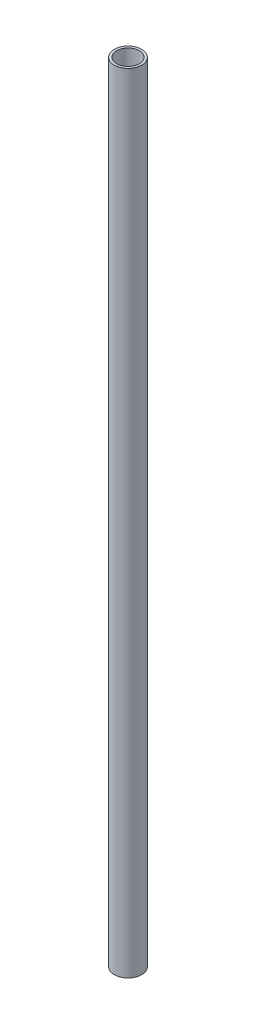
ISO-10303-21;
HEADER;
FILE_DESCRIPTION(('STEP AP214'),'2;1');
FILE_NAME('part.step','',(''),(''),'','','');
FILE_SCHEMA(('AUTOMOTIVE_DESIGN { 1 0 10303 214 1 1 1 1 }'));
ENDSEC;
DATA;
#1=APPLICATION_CONTEXT('core data for automotive mechanical design processes');
#2=APPLICATION_PROTOCOL_DEFINITION('international standard','automotive_design',2000,#1);
#3=PRODUCT_CONTEXT('',#1,'mechanical');
#4=PRODUCT('Part','Part','',(#3));
#5=PRODUCT_RELATED_PRODUCT_CATEGORY('part','',(#4));
#6=PRODUCT_DEFINITION_FORMATION('','',#4);
#7=PRODUCT_DEFINITION_CONTEXT('part definition',#1,'design');
#8=PRODUCT_DEFINITION('design','',#6,#7);
#9=PRODUCT_DEFINITION_SHAPE('','',#8);
#10=(LENGTH_UNIT() NAMED_UNIT(*) SI_UNIT(.MILLI.,.METRE.));
#11=(NAMED_UNIT(*) PLANE_ANGLE_UNIT() SI_UNIT($,.RADIAN.));
#12=(NAMED_UNIT(*) SI_UNIT($,.STERADIAN.) SOLID_ANGLE_UNIT());
#13=UNCERTAINTY_MEASURE_WITH_UNIT(LENGTH_MEASURE(1.E-05),#10,'distance_accuracy_value','');
#14=(GEOMETRIC_REPRESENTATION_CONTEXT(3) GLOBAL_UNCERTAINTY_ASSIGNED_CONTEXT((#13)) GLOBAL_UNIT_ASSIGNED_CONTEXT((#10,
#11,#12)) REPRESENTATION_CONTEXT('',''));
#15=CARTESIAN_POINT('',(0.,0.,0.));
#16=DIRECTION('',(0.,0.,1.));
#17=DIRECTION('',(1.,0.,0.));
#18=AXIS2_PLACEMENT_3D('',#15,#16,#17);
#19=CARTESIAN_POINT('',(0.,546.1,0.));
#20=DIRECTION('',(0.,-1.,0.));
#21=DIRECTION('',(0.,0.,-1.));
#22=AXIS2_PLACEMENT_3D('',#19,#20,#21);
#23=CYLINDRICAL_SURFACE('',#22,9.525);
#24=CARTESIAN_POINT('',(0.,546.1,0.));
#25=DIRECTION('',(0.,1.,0.));
#26=DIRECTION('',(0.,0.,1.));
#27=AXIS2_PLACEMENT_3D('',#24,#25,#26);
#28=CIRCLE('',#27,9.525);
#29=CARTESIAN_POINT('',(0.,546.1,9.525));
#30=VERTEX_POINT('',#29);
#31=EDGE_CURVE('E10',#30,#30,#28,.T.);
#32=ORIENTED_EDGE('',*,*,#31,.F.);
#33=EDGE_LOOP('',(#32));
#34=FACE_BOUND('',#33,.T.);
#35=CARTESIAN_POINT('',(0.,0.,0.));
#36=DIRECTION('',(0.,1.,0.));
#37=DIRECTION('',(0.,0.,1.));
#38=AXIS2_PLACEMENT_3D('',#35,#36,#37);
#39=CIRCLE('',#38,9.525);
#40=CARTESIAN_POINT('',(0.,0.,9.525));
#41=VERTEX_POINT('',#40);
#42=EDGE_CURVE('E47',#41,#41,#39,.T.);
#43=ORIENTED_EDGE('',*,*,#42,.T.);
#44=EDGE_LOOP('',(#43));
#45=FACE_BOUND('',#44,.T.);
#46=CARTESIAN_POINT('',(0.70182659001416,6.34999999999997,-9.49910861278831));
#47=CARTESIAN_POINT('',(0.701830425661844,6.43850360008196,-9.49910931448811));
#48=CARTESIAN_POINT('',(0.709339903143834,6.52705552985514,-9.49856271931088));
#49=CARTESIAN_POINT('',(0.73914114067249,6.70167477497227,-9.49628928458247));
#50=CARTESIAN_POINT('',(0.761446533018649,6.78773972253638,-9.49456135655856));
#51=CARTESIAN_POINT('',(0.820071790311437,6.95483259992182,-9.48967683733146));
#52=CARTESIAN_POINT('',(0.856379942635018,7.03586467390046,-9.48652143975602));
#53=CARTESIAN_POINT('',(0.941838491318716,7.19072790624575,-9.4784175389685));
#54=CARTESIAN_POINT('',(0.990987442481666,7.26455987368155,-9.47346923751867));
#55=CARTESIAN_POINT('',(1.10111043538638,7.40366365958773,-9.46130370946585));
#56=CARTESIAN_POINT('',(1.16218497939736,7.46885420843018,-9.45406685023204));
#57=CARTESIAN_POINT('',(1.29404812032065,7.58811874985718,-9.43692092075347));
#58=CARTESIAN_POINT('',(1.36483729255761,7.64219208357822,-9.42701169221072));
#59=CARTESIAN_POINT('',(1.51449734229077,7.73799225018417,-9.40413092200805));
#60=CARTESIAN_POINT('',(1.59341394308883,7.77964344990963,-9.39114145211831));
#61=CARTESIAN_POINT('',(1.75662974584085,7.84893087978683,-9.36198381502255));
#62=CARTESIAN_POINT('',(1.84092859741093,7.87656802120682,-9.34581585459371));
#63=CARTESIAN_POINT('',(2.01160302448579,7.9167942597147,-9.31056377324197));
#64=CARTESIAN_POINT('',(2.0979522486908,7.92951990166291,-9.29150794718033));
#65=CARTESIAN_POINT('',(2.27093107961967,7.93998650388682,-9.25075077348331));
#66=CARTESIAN_POINT('',(2.35756066688564,7.93772848268192,-9.22904960576432));
#67=CARTESIAN_POINT('',(2.52774621700173,7.91839834177951,-9.1838881646519));
#68=CARTESIAN_POINT('',(2.6113241244069,7.90147317123512,-9.16044744339301));
#69=CARTESIAN_POINT('',(2.77400754332395,7.85352056785341,-9.11250258745171));
#70=CARTESIAN_POINT('',(2.85311291853981,7.82249270551059,-9.08799842040202));
#71=CARTESIAN_POINT('',(3.00511855092452,7.7470694433997,-9.03887732382664));
#72=CARTESIAN_POINT('',(3.0779887405165,7.70261349232758,-9.01426039167741));
#73=CARTESIAN_POINT('',(3.21527487209395,7.60164035762668,-8.96621048941902));
#74=CARTESIAN_POINT('',(3.27969012915061,7.54512219781857,-8.94277761532412));
#75=CARTESIAN_POINT('',(3.39920152166464,7.42081395779668,-8.89804375335308));
#76=CARTESIAN_POINT('',(3.45417511594069,7.35289544473781,-8.87677207864973));
#77=CARTESIAN_POINT('',(3.55245605313273,7.2081471977129,-8.83790036162596));
#78=CARTESIAN_POINT('',(3.59576328843563,7.13131738155635,-8.82030035317413));
#79=CARTESIAN_POINT('',(3.66964284544777,6.97078130740775,-8.78982099024054));
#80=CARTESIAN_POINT('',(3.70020084883979,6.88706744371147,-8.77694694529859));
#81=CARTESIAN_POINT('',(3.74769225599735,6.71522083908467,-8.75677451691312));
#82=CARTESIAN_POINT('',(3.76462685941796,6.62708848796537,-8.74947564253175));
#83=CARTESIAN_POINT('',(3.7842889121477,6.45003399083701,-8.74098949283711));
#84=CARTESIAN_POINT('',(3.78718362565519,6.36113384888913,-8.73973026621225));
#85=CARTESIAN_POINT('',(3.77914023661004,6.1840829634763,-8.74321122633754));
#86=CARTESIAN_POINT('',(3.76820266834298,6.0959321911986,-8.74795118136336));
#87=CARTESIAN_POINT('',(3.73290722327832,5.92345287291378,-8.76306964769297));
#88=CARTESIAN_POINT('',(3.70863467588485,5.83910367617744,-8.7734123019779));
#89=CARTESIAN_POINT('',(3.64736302234473,5.67596644441251,-8.79906042876483));
#90=CARTESIAN_POINT('',(3.61036315486636,5.59717874240516,-8.81436619815077));
#91=CARTESIAN_POINT('',(3.52417082208061,5.44660163255211,-8.84918171740491));
#92=CARTESIAN_POINT('',(3.47486904586504,5.3748834762999,-8.86872894063804));
#93=CARTESIAN_POINT('',(3.36547355377802,5.24121790673867,-8.91081585449821));
#94=CARTESIAN_POINT('',(3.30537907883953,5.17927118124531,-8.93335575557578));
#95=CARTESIAN_POINT('',(3.17520227844955,5.06625104811727,-8.98045359896899));
#96=CARTESIAN_POINT('',(3.10502258120932,5.01529742030932,-9.00503009063644));
#97=CARTESIAN_POINT('',(2.95695680115594,4.9265488673519,-9.05472920927627));
#98=CARTESIAN_POINT('',(2.87907096772522,4.88875351655911,-9.07985181855493));
#99=CARTESIAN_POINT('',(2.7180273101702,4.82758077918867,-9.12934890688175));
#100=CARTESIAN_POINT('',(2.63489417941533,4.80414071190833,-9.15372619033298));
#101=CARTESIAN_POINT('',(2.46536326382579,4.77214209465798,-9.20083384291461));
#102=CARTESIAN_POINT('',(2.37896574821164,4.76358232020496,-9.22356434740912));
#103=CARTESIAN_POINT('',(2.20645165739057,4.76162250473177,-9.26633690553455));
#104=CARTESIAN_POINT('',(2.1203443407914,4.76804021374744,-9.28640817151895));
#105=CARTESIAN_POINT('',(1.94985361436068,4.79545899064108,-9.32369630444181));
#106=CARTESIAN_POINT('',(1.86547019487873,4.81645997685858,-9.34091318736299));
#107=CARTESIAN_POINT('',(1.70095881235096,4.87237923512029,-9.37226623600038));
#108=CARTESIAN_POINT('',(1.62082622351559,4.90728201181364,-9.38640580473806));
#109=CARTESIAN_POINT('',(1.46700870447307,4.98999378950617,-9.41167323172129));
#110=CARTESIAN_POINT('',(1.39332408013091,5.03780340231372,-9.42280094714923));
#111=CARTESIAN_POINT('',(1.25371308621344,5.14561778371337,-9.44239703911404));
#112=CARTESIAN_POINT('',(1.18788528326487,5.20575600627062,-9.45083348440504));
#113=CARTESIAN_POINT('',(1.06691623804853,5.33624047551534,-9.46525411595275));
#114=CARTESIAN_POINT('',(1.01177750247089,5.4065891098961,-9.47123772736188));
#115=CARTESIAN_POINT('',(0.913540594989928,5.55608827979237,-9.48121990883733));
#116=CARTESIAN_POINT('',(0.870530351001087,5.63529755579725,-9.48520413830248));
#117=CARTESIAN_POINT('',(0.79850256277031,5.79984186480364,-9.49154029198385));
#118=CARTESIAN_POINT('',(0.769471040233305,5.88517067991212,-9.49389384786229));
#119=CARTESIAN_POINT('',(0.732628925952331,6.03402639361793,-9.4967944793917));
#120=CARTESIAN_POINT('',(0.721098394521577,6.09665202305446,-9.49766824935162));
#121=CARTESIAN_POINT('',(0.705695918092864,6.2228434628732,-9.49882505859865));
#122=CARTESIAN_POINT('',(0.701823834061983,6.28640925616638,-9.49910810860981));
#123=CARTESIAN_POINT('',(0.70182659001416,6.34999999999997,-9.49910861278831));
#124=B_SPLINE_CURVE_WITH_KNOTS('',3,(#46,#47,#48,#49,#50,#51,#52,#53,#54,#55,#56,#57,#58,#59,
#60,#61,#62,#63,#64,#65,#66,#67,#68,#69,#70,#71,#72,#73,#74,#75,#76,#77,#78,#79,#80,#81,#82,#83,
#84,#85,#86,#87,#88,#89,#90,#91,#92,#93,#94,#95,#96,#97,#98,#99,#100,#101,#102,#103,#104,#105,
#106,#107,#108,#109,#110,#111,#112,#113,#114,#115,#116,#117,#118,#119,#120,#121,#122,#123),
.UNSPECIFIED.,.T.,.F.,(4,2,2,2,2,2,2,2,2,2,2,2,2,2,2,2,2,2,2,2,2,2,2,2,2,2,2,2,2,2,2,2,2,2,2,2,
2,2,4),(0.,0.265278259719109,0.530801275176472,0.796102673650723,1.06137422602346,
1.32898616063875,1.5966139507487,1.86583942370756,2.13504738795551,2.40177045345073,
2.66847538854452,2.93253871939557,3.19661009298445,3.46189048628526,3.72719235653986,
3.99571288398438,4.26423588823711,4.53305965686601,4.80185975070666,5.06744949436947,
5.33302897967861,5.59692851043523,5.86084383006405,6.127193376543,6.39356166313471,
6.6627001177745,6.93182986552685,7.19977595105187,7.46769998654323,7.73238087928837,
7.99706028993932,8.26144550293589,8.52584325049111,8.79327043389143,9.06076025589927,
9.33014217036899,9.59925414881132,9.78986275793694,9.98046790668557),.UNSPECIFIED.);
#125=CARTESIAN_POINT('',(0.70182659001416,6.34999999999997,-9.49910861278831));
#126=VERTEX_POINT('',#125);
#127=EDGE_CURVE('E39',#126,#126,#124,.T.);
#128=ORIENTED_EDGE('',*,*,#127,.F.);
#129=EDGE_LOOP('',(#128));
#130=FACE_BOUND('',#129,.T.);
#131=ADVANCED_FACE('F35',(#34,#45,#130),#23,.T.);
#132=CARTESIAN_POINT('',(0.,546.1,0.));
#133=DIRECTION('',(0.,1.,0.));
#134=DIRECTION('',(0.,0.,1.));
#135=AXIS2_PLACEMENT_3D('',#132,#133,#134);
#136=PLANE('',#135);
#137=ORIENTED_EDGE('',*,*,#31,.T.);
#138=EDGE_LOOP('',(#137));
#139=FACE_BOUND('',#138,.T.);
#140=CARTESIAN_POINT('',(0.,546.1,0.));
#141=DIRECTION('',(0.,1.,0.));
#142=DIRECTION('',(0.,0.,1.));
#143=AXIS2_PLACEMENT_3D('',#140,#141,#142);
#144=CIRCLE('',#143,7.874);
#145=CARTESIAN_POINT('',(0.,546.1,7.874));
#146=VERTEX_POINT('',#145);
#147=EDGE_CURVE('E53',#146,#146,#144,.T.);
#148=ORIENTED_EDGE('',*,*,#147,.F.);
#149=EDGE_LOOP('',(#148));
#150=FACE_BOUND('',#149,.T.);
#151=ADVANCED_FACE('F73',(#139,#150),#136,.T.);
#152=CARTESIAN_POINT('',(0.,0.,0.));
#153=DIRECTION('',(0.,1.,0.));
#154=DIRECTION('',(0.,0.,1.));
#155=AXIS2_PLACEMENT_3D('',#152,#153,#154);
#156=PLANE('',#155);
#157=ORIENTED_EDGE('',*,*,#42,.F.);
#158=EDGE_LOOP('',(#157));
#159=FACE_BOUND('',#158,.T.);
#160=CARTESIAN_POINT('',(0.,0.,0.));
#161=DIRECTION('',(0.,1.,0.));
#162=DIRECTION('',(0.,0.,1.));
#163=AXIS2_PLACEMENT_3D('',#160,#161,#162);
#164=CIRCLE('',#163,7.874);
#165=CARTESIAN_POINT('',(0.,0.,7.874));
#166=VERTEX_POINT('',#165);
#167=EDGE_CURVE('E55',#166,#166,#164,.T.);
#168=ORIENTED_EDGE('',*,*,#167,.T.);
#169=EDGE_LOOP('',(#168));
#170=FACE_BOUND('',#169,.T.);
#171=ADVANCED_FACE('F78',(#159,#170),#156,.F.);
#172=CARTESIAN_POINT('',(0.,546.1,0.));
#173=DIRECTION('',(0.,-1.,0.));
#174=DIRECTION('',(0.,0.,-1.));
#175=AXIS2_PLACEMENT_3D('',#172,#173,#174);
#176=CYLINDRICAL_SURFACE('',#175,7.874);
#177=ORIENTED_EDGE('',*,*,#147,.T.);
#178=EDGE_LOOP('',(#177));
#179=FACE_BOUND('',#178,.T.);
#180=ORIENTED_EDGE('',*,*,#167,.F.);
#181=EDGE_LOOP('',(#180));
#182=FACE_BOUND('',#181,.T.);
#183=ADVANCED_FACE('F85',(#179,#182),#176,.F.);
#184=CARTESIAN_POINT('',(1.92267353832014,6.34999999999997,-7.81618185326455));
#185=DIRECTION('',(0.238865629277557,0.,-0.971052630473671));
#186=DIRECTION('',(-0.971052630473672,0.,-0.238865629277557));
#187=AXIS2_PLACEMENT_3D('',#184,#185,#186);
#188=CYLINDRICAL_SURFACE('',#187,1.58749999999996);
#189=CARTESIAN_POINT('',(1.92267353832014,6.34999999999997,-7.81618185326455));
#190=DIRECTION('',(-0.238865629277557,0.,0.971052630473672));
#191=DIRECTION('',(0.971052630473672,0.,0.238865629277557));
#192=AXIS2_PLACEMENT_3D('',#189,#190,#191);
#193=CIRCLE('',#192,1.58749999999996);
#194=CARTESIAN_POINT('',(3.46421958919705,6.34999999999997,-7.43698266678644));
#195=VERTEX_POINT('',#194);
#196=EDGE_CURVE('E61',#195,#195,#193,.T.);
#197=ORIENTED_EDGE('',*,*,#196,.T.);
#198=EDGE_LOOP('',(#197));
#199=FACE_BOUND('',#198,.T.);
#200=ORIENTED_EDGE('',*,*,#127,.T.);
#201=EDGE_LOOP('',(#200));
#202=FACE_BOUND('',#201,.T.);
#203=ADVANCED_FACE('F70',(#199,#202),#188,.F.);
#204=CARTESIAN_POINT('',(1.92267353832014,6.34999999999997,-7.81618185326455));
#205=DIRECTION('',(-0.238865629277557,0.,0.971052630473672));
#206=DIRECTION('',(0.971052630473672,0.,0.238865629277557));
#207=AXIS2_PLACEMENT_3D('',#204,#205,#206);
#208=PLANE('',#207);
#209=ORIENTED_EDGE('',*,*,#196,.F.);
#210=EDGE_LOOP('',(#209));
#211=FACE_BOUND('',#210,.T.);
#212=ADVANCED_FACE('F92',(#211),#208,.F.);
#213=CLOSED_SHELL('',(#131,#151,#171,#183,#203,#212));
#214=MANIFOLD_SOLID_BREP('B2',#213);
#215=ADVANCED_BREP_SHAPE_REPRESENTATION('',(#18,#214),#14);
#216=SHAPE_DEFINITION_REPRESENTATION(#9,#215);
ENDSEC;
END-ISO-10303-21;
